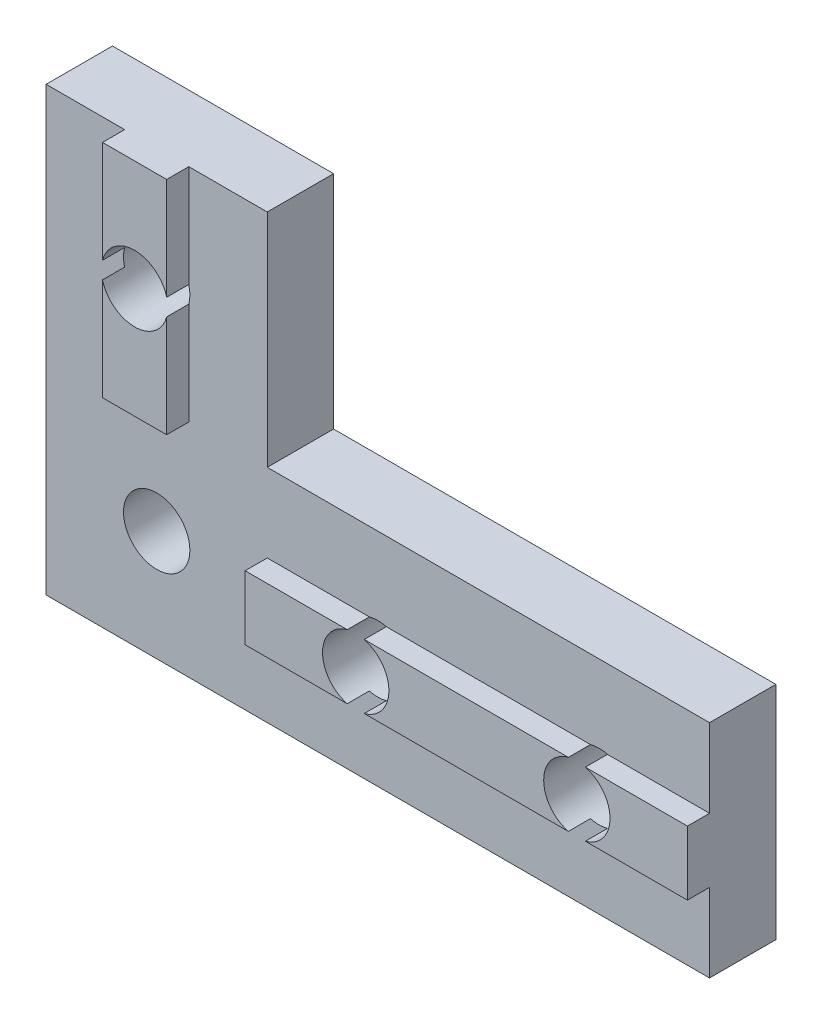
ISO-10303-21;
HEADER;
FILE_DESCRIPTION(('STEP AP214'),'2;1');
FILE_NAME('part.step','',(''),(''),'','','');
FILE_SCHEMA(('AUTOMOTIVE_DESIGN { 1 0 10303 214 1 1 1 1 }'));
ENDSEC;
DATA;
#1=APPLICATION_CONTEXT('core data for automotive mechanical design processes');
#2=APPLICATION_PROTOCOL_DEFINITION('international standard','automotive_design',2000,#1);
#3=PRODUCT_CONTEXT('',#1,'mechanical');
#4=PRODUCT('Part','Part','',(#3));
#5=PRODUCT_RELATED_PRODUCT_CATEGORY('part','',(#4));
#6=PRODUCT_DEFINITION_FORMATION('','',#4);
#7=PRODUCT_DEFINITION_CONTEXT('part definition',#1,'design');
#8=PRODUCT_DEFINITION('design','',#6,#7);
#9=PRODUCT_DEFINITION_SHAPE('','',#8);
#10=(LENGTH_UNIT() NAMED_UNIT(*) SI_UNIT(.MILLI.,.METRE.));
#11=(NAMED_UNIT(*) PLANE_ANGLE_UNIT() SI_UNIT($,.RADIAN.));
#12=(NAMED_UNIT(*) SI_UNIT($,.STERADIAN.) SOLID_ANGLE_UNIT());
#13=UNCERTAINTY_MEASURE_WITH_UNIT(LENGTH_MEASURE(1.E-05),#10,'distance_accuracy_value','');
#14=(GEOMETRIC_REPRESENTATION_CONTEXT(3) GLOBAL_UNCERTAINTY_ASSIGNED_CONTEXT((#13)) GLOBAL_UNIT_ASSIGNED_CONTEXT((#10,
#11,#12)) REPRESENTATION_CONTEXT('',''));
#15=CARTESIAN_POINT('',(0.,0.,0.));
#16=DIRECTION('',(0.,0.,1.));
#17=DIRECTION('',(1.,0.,0.));
#18=AXIS2_PLACEMENT_3D('',#15,#16,#17);
#19=CARTESIAN_POINT('',(30.,6.45,4.));
#20=DIRECTION('',(0.,-1.,0.));
#21=DIRECTION('',(0.,0.,-1.));
#22=AXIS2_PLACEMENT_3D('',#19,#20,#21);
#23=PLANE('',#22);
#24=DIRECTION('',(-1.,0.,0.));
#25=VECTOR('',#24,1.);
#26=CARTESIAN_POINT('',(30.,6.45,4.));
#27=LINE('',#26,#25);
#28=CARTESIAN_POINT('',(14.6159427126066,6.45,4.));
#29=VERTEX_POINT('',#28);
#30=CARTESIAN_POINT('',(10.,6.45,4.));
#31=VERTEX_POINT('',#30);
#32=EDGE_CURVE('E228',#29,#31,#27,.T.);
#33=ORIENTED_EDGE('',*,*,#32,.F.);
#34=DIRECTION('',(0.,0.,-1.));
#35=VECTOR('',#34,1.);
#36=CARTESIAN_POINT('',(14.6159427126066,6.45,4.));
#37=LINE('',#36,#35);
#38=CARTESIAN_POINT('',(14.6159427126066,6.45,3.));
#39=VERTEX_POINT('',#38);
#40=EDGE_CURVE('E55',#29,#39,#37,.T.);
#41=ORIENTED_EDGE('',*,*,#40,.T.);
#42=DIRECTION('',(-1.,0.,0.));
#43=VECTOR('',#42,1.);
#44=CARTESIAN_POINT('',(30.,6.45,3.));
#45=LINE('',#44,#43);
#46=CARTESIAN_POINT('',(10.,6.45,3.));
#47=VERTEX_POINT('',#46);
#48=EDGE_CURVE('E247',#39,#47,#45,.T.);
#49=ORIENTED_EDGE('',*,*,#48,.T.);
#50=DIRECTION('',(0.,0.,-1.));
#51=VECTOR('',#50,1.);
#52=CARTESIAN_POINT('',(10.,6.45,4.));
#53=LINE('',#52,#51);
#54=EDGE_CURVE('E259',#31,#47,#53,.T.);
#55=ORIENTED_EDGE('',*,*,#54,.F.);
#56=EDGE_LOOP('',(#33,#41,#49,#55));
#57=FACE_BOUND('',#56,.T.);
#58=ADVANCED_FACE('F33',(#57),#23,.F.);
#59=CARTESIAN_POINT('',(6.45,20.,4.));
#60=DIRECTION('',(-1.,0.,0.));
#61=DIRECTION('',(0.,-1.,0.));
#62=AXIS2_PLACEMENT_3D('',#59,#60,#61);
#63=PLANE('',#62);
#64=DIRECTION('',(0.,1.,0.));
#65=VECTOR('',#64,1.);
#66=CARTESIAN_POINT('',(6.45,20.,4.));
#67=LINE('',#66,#65);
#68=CARTESIAN_POINT('',(6.45,15.3840572873934,4.));
#69=VERTEX_POINT('',#68);
#70=CARTESIAN_POINT('',(6.45,20.,4.));
#71=VERTEX_POINT('',#70);
#72=EDGE_CURVE('E269',#69,#71,#67,.T.);
#73=ORIENTED_EDGE('',*,*,#72,.F.);
#74=DIRECTION('',(0.,0.,-1.));
#75=VECTOR('',#74,1.);
#76=CARTESIAN_POINT('',(6.45,15.3840572873934,4.));
#77=LINE('',#76,#75);
#78=CARTESIAN_POINT('',(6.45,15.3840572873934,3.));
#79=VERTEX_POINT('',#78);
#80=EDGE_CURVE('E420',#69,#79,#77,.T.);
#81=ORIENTED_EDGE('',*,*,#80,.T.);
#82=DIRECTION('',(0.,1.,0.));
#83=VECTOR('',#82,1.);
#84=CARTESIAN_POINT('',(6.45,20.,3.));
#85=LINE('',#84,#83);
#86=CARTESIAN_POINT('',(6.45,20.,3.));
#87=VERTEX_POINT('',#86);
#88=EDGE_CURVE('E264',#79,#87,#85,.T.);
#89=ORIENTED_EDGE('',*,*,#88,.T.);
#90=DIRECTION('',(0.,0.,-1.));
#91=VECTOR('',#90,1.);
#92=CARTESIAN_POINT('',(6.45,20.,4.));
#93=LINE('',#92,#91);
#94=EDGE_CURVE('E296',#71,#87,#93,.T.);
#95=ORIENTED_EDGE('',*,*,#94,.F.);
#96=EDGE_LOOP('',(#73,#81,#89,#95));
#97=FACE_BOUND('',#96,.T.);
#98=ADVANCED_FACE('F419',(#97),#63,.F.);
#99=CARTESIAN_POINT('',(3.55,20.,4.));
#100=DIRECTION('',(1.,0.,0.));
#101=DIRECTION('',(0.,1.,0.));
#102=AXIS2_PLACEMENT_3D('',#99,#100,#101);
#103=PLANE('',#102);
#104=DIRECTION('',(0.,-1.,0.));
#105=VECTOR('',#104,1.);
#106=CARTESIAN_POINT('',(3.55,20.,4.));
#107=LINE('',#106,#105);
#108=CARTESIAN_POINT('',(3.55,14.6159427126066,4.));
#109=VERTEX_POINT('',#108);
#110=CARTESIAN_POINT('',(3.55,10.,4.));
#111=VERTEX_POINT('',#110);
#112=EDGE_CURVE('E271',#109,#111,#107,.T.);
#113=ORIENTED_EDGE('',*,*,#112,.F.);
#114=DIRECTION('',(0.,0.,-1.));
#115=VECTOR('',#114,1.);
#116=CARTESIAN_POINT('',(3.55,14.6159427126066,4.));
#117=LINE('',#116,#115);
#118=CARTESIAN_POINT('',(3.55,14.6159427126066,3.));
#119=VERTEX_POINT('',#118);
#120=EDGE_CURVE('E48',#109,#119,#117,.T.);
#121=ORIENTED_EDGE('',*,*,#120,.T.);
#122=DIRECTION('',(0.,-1.,0.));
#123=VECTOR('',#122,1.);
#124=CARTESIAN_POINT('',(3.55,20.,3.));
#125=LINE('',#124,#123);
#126=CARTESIAN_POINT('',(3.55,10.,3.));
#127=VERTEX_POINT('',#126);
#128=EDGE_CURVE('E281',#119,#127,#125,.T.);
#129=ORIENTED_EDGE('',*,*,#128,.T.);
#130=DIRECTION('',(0.,0.,-1.));
#131=VECTOR('',#130,1.);
#132=CARTESIAN_POINT('',(3.55,10.,4.));
#133=LINE('',#132,#131);
#134=EDGE_CURVE('E290',#111,#127,#133,.T.);
#135=ORIENTED_EDGE('',*,*,#134,.F.);
#136=EDGE_LOOP('',(#113,#121,#129,#135));
#137=FACE_BOUND('',#136,.T.);
#138=ADVANCED_FACE('F485',(#137),#103,.F.);
#139=CARTESIAN_POINT('',(0.,0.,4.));
#140=DIRECTION('',(0.,0.,-1.));
#141=DIRECTION('',(-1.,0.,0.));
#142=AXIS2_PLACEMENT_3D('',#139,#140,#141);
#143=PLANE('',#142);
#144=CARTESIAN_POINT('',(3.55,20.,4.));
#145=VERTEX_POINT('',#144);
#146=CARTESIAN_POINT('',(3.55,15.3840572873934,4.));
#147=VERTEX_POINT('',#146);
#148=EDGE_CURVE('E272',#145,#147,#107,.T.);
#149=ORIENTED_EDGE('',*,*,#148,.T.);
#150=CARTESIAN_POINT('',(5.,15.,4.));
#151=DIRECTION('',(0.,0.,-1.));
#152=DIRECTION('',(-1.,0.,0.));
#153=AXIS2_PLACEMENT_3D('',#150,#151,#152);
#154=CIRCLE('',#153,1.5);
#155=EDGE_CURVE('E448',#147,#69,#154,.T.);
#156=ORIENTED_EDGE('',*,*,#155,.T.);
#157=ORIENTED_EDGE('',*,*,#72,.T.);
#158=DIRECTION('',(-1.,0.,0.));
#159=VECTOR('',#158,1.);
#160=CARTESIAN_POINT('',(6.45,20.,4.));
#161=LINE('',#160,#159);
#162=EDGE_CURVE('E268',#71,#145,#161,.T.);
#163=ORIENTED_EDGE('',*,*,#162,.T.);
#164=EDGE_LOOP('',(#149,#156,#157,#163));
#165=FACE_BOUND('',#164,.T.);
#166=ADVANCED_FACE('F477',(#165),#143,.F.);
#167=CARTESIAN_POINT('',(30.,3.55,4.));
#168=DIRECTION('',(0.,1.,0.));
#169=DIRECTION('',(-1.,0.,0.));
#170=AXIS2_PLACEMENT_3D('',#167,#168,#169);
#171=PLANE('',#170);
#172=DIRECTION('',(1.,0.,0.));
#173=VECTOR('',#172,1.);
#174=CARTESIAN_POINT('',(30.,3.55,4.));
#175=LINE('',#174,#173);
#176=CARTESIAN_POINT('',(15.3840572873934,3.55,4.));
#177=VERTEX_POINT('',#176);
#178=CARTESIAN_POINT('',(24.6159427126066,3.55,4.));
#179=VERTEX_POINT('',#178);
#180=EDGE_CURVE('E242',#177,#179,#175,.T.);
#181=ORIENTED_EDGE('',*,*,#180,.F.);
#182=DIRECTION('',(0.,0.,-1.));
#183=VECTOR('',#182,1.);
#184=CARTESIAN_POINT('',(15.3840572873934,3.55,4.));
#185=LINE('',#184,#183);
#186=CARTESIAN_POINT('',(15.3840572873934,3.55,3.));
#187=VERTEX_POINT('',#186);
#188=EDGE_CURVE('E208',#177,#187,#185,.T.);
#189=ORIENTED_EDGE('',*,*,#188,.T.);
#190=DIRECTION('',(1.,0.,0.));
#191=VECTOR('',#190,1.);
#192=CARTESIAN_POINT('',(30.,3.55,3.));
#193=LINE('',#192,#191);
#194=CARTESIAN_POINT('',(24.6159427126066,3.55,3.));
#195=VERTEX_POINT('',#194);
#196=EDGE_CURVE('E254',#187,#195,#193,.T.);
#197=ORIENTED_EDGE('',*,*,#196,.T.);
#198=DIRECTION('',(0.,0.,-1.));
#199=VECTOR('',#198,1.);
#200=CARTESIAN_POINT('',(24.6159427126066,3.55,4.));
#201=LINE('',#200,#199);
#202=EDGE_CURVE('E368',#195,#179,#201,.F.);
#203=ORIENTED_EDGE('',*,*,#202,.T.);
#204=EDGE_LOOP('',(#181,#189,#197,#203));
#205=FACE_BOUND('',#204,.T.);
#206=ADVANCED_FACE('F371',(#205),#171,.F.);
#207=CARTESIAN_POINT('',(0.,0.,4.));
#208=DIRECTION('',(0.,0.,-1.));
#209=DIRECTION('',(-1.,0.,0.));
#210=AXIS2_PLACEMENT_3D('',#207,#208,#209);
#211=PLANE('',#210);
#212=CARTESIAN_POINT('',(24.6159427126066,6.45,4.));
#213=VERTEX_POINT('',#212);
#214=CARTESIAN_POINT('',(15.3840572873934,6.45,4.));
#215=VERTEX_POINT('',#214);
#216=EDGE_CURVE('E218',#213,#215,#27,.T.);
#217=ORIENTED_EDGE('',*,*,#216,.T.);
#218=CARTESIAN_POINT('',(15.,5.,4.));
#219=DIRECTION('',(0.,0.,-1.));
#220=DIRECTION('',(-1.,0.,0.));
#221=AXIS2_PLACEMENT_3D('',#218,#219,#220);
#222=CIRCLE('',#221,1.5);
#223=EDGE_CURVE('E41',#215,#177,#222,.T.);
#224=ORIENTED_EDGE('',*,*,#223,.T.);
#225=ORIENTED_EDGE('',*,*,#180,.T.);
#226=CARTESIAN_POINT('',(25.,5.,4.));
#227=DIRECTION('',(0.,0.,-1.));
#228=DIRECTION('',(-1.,0.,0.));
#229=AXIS2_PLACEMENT_3D('',#226,#227,#228);
#230=CIRCLE('',#229,1.5);
#231=EDGE_CURVE('E226',#179,#213,#230,.T.);
#232=ORIENTED_EDGE('',*,*,#231,.T.);
#233=EDGE_LOOP('',(#217,#224,#225,#232));
#234=FACE_BOUND('',#233,.T.);
#235=ADVANCED_FACE('F224',(#234),#211,.F.);
#236=CARTESIAN_POINT('',(24.6159427126066,6.45,3.));
#237=VERTEX_POINT('',#236);
#238=CARTESIAN_POINT('',(15.3840572873934,6.45,3.));
#239=VERTEX_POINT('',#238);
#240=EDGE_CURVE('E220',#237,#239,#45,.T.);
#241=ORIENTED_EDGE('',*,*,#240,.T.);
#242=DIRECTION('',(0.,0.,-1.));
#243=VECTOR('',#242,1.);
#244=CARTESIAN_POINT('',(15.3840572873934,6.45,4.));
#245=LINE('',#244,#243);
#246=EDGE_CURVE('E205',#239,#215,#245,.F.);
#247=ORIENTED_EDGE('',*,*,#246,.T.);
#248=ORIENTED_EDGE('',*,*,#216,.F.);
#249=DIRECTION('',(0.,0.,-1.));
#250=VECTOR('',#249,1.);
#251=CARTESIAN_POINT('',(24.6159427126066,6.45,4.));
#252=LINE('',#251,#250);
#253=EDGE_CURVE('E370',#213,#237,#252,.T.);
#254=ORIENTED_EDGE('',*,*,#253,.T.);
#255=EDGE_LOOP('',(#241,#247,#248,#254));
#256=FACE_BOUND('',#255,.T.);
#257=ADVANCED_FACE('F216',(#256),#23,.F.);
#258=CARTESIAN_POINT('',(25.3840572873934,3.55,4.));
#259=VERTEX_POINT('',#258);
#260=CARTESIAN_POINT('',(30.,3.55,4.));
#261=VERTEX_POINT('',#260);
#262=EDGE_CURVE('E237',#259,#261,#175,.T.);
#263=ORIENTED_EDGE('',*,*,#262,.F.);
#264=DIRECTION('',(0.,0.,-1.));
#265=VECTOR('',#264,1.);
#266=CARTESIAN_POINT('',(25.3840572873934,3.55,4.));
#267=LINE('',#266,#265);
#268=CARTESIAN_POINT('',(25.3840572873934,3.55,3.));
#269=VERTEX_POINT('',#268);
#270=EDGE_CURVE('E361',#259,#269,#267,.T.);
#271=ORIENTED_EDGE('',*,*,#270,.T.);
#272=CARTESIAN_POINT('',(30.,3.55,3.));
#273=VERTEX_POINT('',#272);
#274=EDGE_CURVE('E250',#269,#273,#193,.T.);
#275=ORIENTED_EDGE('',*,*,#274,.T.);
#276=DIRECTION('',(0.,0.,-1.));
#277=VECTOR('',#276,1.);
#278=CARTESIAN_POINT('',(30.,3.55,4.));
#279=LINE('',#278,#277);
#280=EDGE_CURVE('E241',#261,#273,#279,.T.);
#281=ORIENTED_EDGE('',*,*,#280,.F.);
#282=EDGE_LOOP('',(#263,#271,#275,#281));
#283=FACE_BOUND('',#282,.T.);
#284=ADVANCED_FACE('F360',(#283),#171,.F.);
#285=CARTESIAN_POINT('',(30.,6.45,4.));
#286=VERTEX_POINT('',#285);
#287=CARTESIAN_POINT('',(25.3840572873934,6.45,4.));
#288=VERTEX_POINT('',#287);
#289=EDGE_CURVE('E227',#286,#288,#27,.T.);
#290=ORIENTED_EDGE('',*,*,#289,.T.);
#291=EDGE_CURVE('E347',#288,#259,#230,.T.);
#292=ORIENTED_EDGE('',*,*,#291,.T.);
#293=ORIENTED_EDGE('',*,*,#262,.T.);
#294=DIRECTION('',(0.,1.,0.));
#295=VECTOR('',#294,1.);
#296=CARTESIAN_POINT('',(30.,6.45,4.));
#297=LINE('',#296,#295);
#298=EDGE_CURVE('E232',#261,#286,#297,.T.);
#299=ORIENTED_EDGE('',*,*,#298,.T.);
#300=EDGE_LOOP('',(#290,#292,#293,#299));
#301=FACE_BOUND('',#300,.T.);
#302=ADVANCED_FACE('F353',(#301),#211,.F.);
#303=CARTESIAN_POINT('',(0.,0.,3.));
#304=DIRECTION('',(0.,0.,1.));
#305=DIRECTION('',(1.,0.,0.));
#306=AXIS2_PLACEMENT_3D('',#303,#304,#305);
#307=PLANE('',#306);
#308=CARTESIAN_POINT('',(15.,5.,3.));
#309=DIRECTION('',(0.,0.,1.));
#310=DIRECTION('',(1.,0.,0.));
#311=AXIS2_PLACEMENT_3D('',#308,#309,#310);
#312=CIRCLE('',#311,1.5);
#313=EDGE_CURVE('E221',#239,#39,#312,.T.);
#314=ORIENTED_EDGE('',*,*,#313,.F.);
#315=ORIENTED_EDGE('',*,*,#240,.F.);
#316=CARTESIAN_POINT('',(25.,5.,3.));
#317=DIRECTION('',(0.,0.,1.));
#318=DIRECTION('',(1.,0.,0.));
#319=AXIS2_PLACEMENT_3D('',#316,#317,#318);
#320=CIRCLE('',#319,1.5);
#321=CARTESIAN_POINT('',(25.3840572873934,6.45,3.));
#322=VERTEX_POINT('',#321);
#323=EDGE_CURVE('E377',#322,#237,#320,.T.);
#324=ORIENTED_EDGE('',*,*,#323,.F.);
#325=CARTESIAN_POINT('',(30.,6.45,3.));
#326=VERTEX_POINT('',#325);
#327=EDGE_CURVE('E243',#326,#322,#45,.T.);
#328=ORIENTED_EDGE('',*,*,#327,.F.);
#329=DIRECTION('',(0.,1.,0.));
#330=VECTOR('',#329,1.);
#331=CARTESIAN_POINT('',(30.,0.,3.));
#332=LINE('',#331,#330);
#333=CARTESIAN_POINT('',(30.,10.,3.));
#334=VERTEX_POINT('',#333);
#335=EDGE_CURVE('E306',#326,#334,#332,.T.);
#336=ORIENTED_EDGE('',*,*,#335,.T.);
#337=DIRECTION('',(-1.,0.,0.));
#338=VECTOR('',#337,1.);
#339=CARTESIAN_POINT('',(30.,10.,3.));
#340=LINE('',#339,#338);
#341=CARTESIAN_POINT('',(10.,10.,3.));
#342=VERTEX_POINT('',#341);
#343=EDGE_CURVE('E310',#334,#342,#340,.T.);
#344=ORIENTED_EDGE('',*,*,#343,.T.);
#345=DIRECTION('',(0.,1.,0.));
#346=VECTOR('',#345,1.);
#347=CARTESIAN_POINT('',(10.,10.,3.));
#348=LINE('',#347,#346);
#349=CARTESIAN_POINT('',(10.,20.,3.));
#350=VERTEX_POINT('',#349);
#351=EDGE_CURVE('E312',#342,#350,#348,.T.);
#352=ORIENTED_EDGE('',*,*,#351,.T.);
#353=DIRECTION('',(-1.,0.,0.));
#354=VECTOR('',#353,1.);
#355=CARTESIAN_POINT('',(10.,20.,3.));
#356=LINE('',#355,#354);
#357=EDGE_CURVE('E315',#350,#87,#356,.T.);
#358=ORIENTED_EDGE('',*,*,#357,.T.);
#359=ORIENTED_EDGE('',*,*,#88,.F.);
#360=CARTESIAN_POINT('',(5.,15.,3.));
#361=DIRECTION('',(0.,0.,1.));
#362=DIRECTION('',(1.,0.,0.));
#363=AXIS2_PLACEMENT_3D('',#360,#361,#362);
#364=CIRCLE('',#363,1.5);
#365=CARTESIAN_POINT('',(6.45,14.6159427126066,3.));
#366=VERTEX_POINT('',#365);
#367=EDGE_CURVE('E415',#366,#79,#364,.T.);
#368=ORIENTED_EDGE('',*,*,#367,.F.);
#369=CARTESIAN_POINT('',(6.45000000000001,10.,3.));
#370=VERTEX_POINT('',#369);
#371=EDGE_CURVE('E278',#370,#366,#85,.T.);
#372=ORIENTED_EDGE('',*,*,#371,.F.);
#373=DIRECTION('',(1.,0.,0.));
#374=VECTOR('',#373,1.);
#375=CARTESIAN_POINT('',(6.45000000000001,10.,3.));
#376=LINE('',#375,#374);
#377=EDGE_CURVE('E285',#127,#370,#376,.T.);
#378=ORIENTED_EDGE('',*,*,#377,.F.);
#379=ORIENTED_EDGE('',*,*,#128,.F.);
#380=CARTESIAN_POINT('',(3.55,15.3840572873934,3.));
#381=VERTEX_POINT('',#380);
#382=EDGE_CURVE('E426',#381,#119,#364,.T.);
#383=ORIENTED_EDGE('',*,*,#382,.F.);
#384=CARTESIAN_POINT('',(3.55,20.,3.));
#385=VERTEX_POINT('',#384);
#386=EDGE_CURVE('E282',#385,#381,#125,.T.);
#387=ORIENTED_EDGE('',*,*,#386,.F.);
#388=CARTESIAN_POINT('',(0.,20.,3.));
#389=VERTEX_POINT('',#388);
#390=EDGE_CURVE('E314',#385,#389,#356,.T.);
#391=ORIENTED_EDGE('',*,*,#390,.T.);
#392=DIRECTION('',(0.,-1.,0.));
#393=VECTOR('',#392,1.);
#394=CARTESIAN_POINT('',(0.,20.,3.));
#395=LINE('',#394,#393);
#396=CARTESIAN_POINT('',(0.,0.,3.));
#397=VERTEX_POINT('',#396);
#398=EDGE_CURVE('E300',#389,#397,#395,.T.);
#399=ORIENTED_EDGE('',*,*,#398,.T.);
#400=DIRECTION('',(1.,0.,0.));
#401=VECTOR('',#400,1.);
#402=CARTESIAN_POINT('',(0.,0.,3.));
#403=LINE('',#402,#401);
#404=CARTESIAN_POINT('',(30.,0.,3.));
#405=VERTEX_POINT('',#404);
#406=EDGE_CURVE('E303',#397,#405,#403,.T.);
#407=ORIENTED_EDGE('',*,*,#406,.T.);
#408=EDGE_CURVE('E307',#405,#273,#332,.T.);
#409=ORIENTED_EDGE('',*,*,#408,.T.);
#410=ORIENTED_EDGE('',*,*,#274,.F.);
#411=EDGE_CURVE('E373',#195,#269,#320,.T.);
#412=ORIENTED_EDGE('',*,*,#411,.F.);
#413=ORIENTED_EDGE('',*,*,#196,.F.);
#414=CARTESIAN_POINT('',(14.6159427126066,3.55,3.));
#415=VERTEX_POINT('',#414);
#416=EDGE_CURVE('E436',#415,#187,#312,.T.);
#417=ORIENTED_EDGE('',*,*,#416,.F.);
#418=CARTESIAN_POINT('',(10.,3.55,3.));
#419=VERTEX_POINT('',#418);
#420=EDGE_CURVE('E251',#419,#415,#193,.T.);
#421=ORIENTED_EDGE('',*,*,#420,.F.);
#422=DIRECTION('',(0.,-1.,0.));
#423=VECTOR('',#422,1.);
#424=CARTESIAN_POINT('',(10.,6.45,3.));
#425=LINE('',#424,#423);
#426=EDGE_CURVE('E246',#47,#419,#425,.T.);
#427=ORIENTED_EDGE('',*,*,#426,.F.);
#428=ORIENTED_EDGE('',*,*,#48,.F.);
#429=EDGE_LOOP('',(#314,#315,#324,#328,#336,#344,#352,#358,#359,#368,#372,#378,#379,#383,#387,
#391,#399,#407,#409,#410,#412,#413,#417,#421,#427,#428));
#430=FACE_BOUND('',#429,.T.);
#431=CARTESIAN_POINT('',(5.,5.,3.));
#432=DIRECTION('',(0.,0.,1.));
#433=DIRECTION('',(1.,0.,0.));
#434=AXIS2_PLACEMENT_3D('',#431,#432,#433);
#435=CIRCLE('',#434,1.5);
#436=CARTESIAN_POINT('',(6.5,5.,3.));
#437=VERTEX_POINT('',#436);
#438=EDGE_CURVE('E379',#437,#437,#435,.T.);
#439=ORIENTED_EDGE('',*,*,#438,.F.);
#440=EDGE_LOOP('',(#439));
#441=FACE_BOUND('',#440,.T.);
#442=ADVANCED_FACE('F388',(#430,#441),#307,.T.);
#443=CARTESIAN_POINT('',(0.,20.,3.));
#444=DIRECTION('',(1.,0.,0.));
#445=DIRECTION('',(0.,1.,0.));
#446=AXIS2_PLACEMENT_3D('',#443,#444,#445);
#447=PLANE('',#446);
#448=DIRECTION('',(0.,-1.,0.));
#449=VECTOR('',#448,1.);
#450=CARTESIAN_POINT('',(0.,20.,0.));
#451=LINE('',#450,#449);
#452=CARTESIAN_POINT('',(0.,20.,0.));
#453=VERTEX_POINT('',#452);
#454=CARTESIAN_POINT('',(0.,0.,0.));
#455=VERTEX_POINT('',#454);
#456=EDGE_CURVE('E299',#453,#455,#451,.T.);
#457=ORIENTED_EDGE('',*,*,#456,.T.);
#458=DIRECTION('',(0.,0.,-1.));
#459=VECTOR('',#458,1.);
#460=CARTESIAN_POINT('',(0.,0.,3.));
#461=LINE('',#460,#459);
#462=EDGE_CURVE('E344',#397,#455,#461,.T.);
#463=ORIENTED_EDGE('',*,*,#462,.F.);
#464=ORIENTED_EDGE('',*,*,#398,.F.);
#465=DIRECTION('',(0.,0.,-1.));
#466=VECTOR('',#465,1.);
#467=CARTESIAN_POINT('',(0.,20.,3.));
#468=LINE('',#467,#466);
#469=EDGE_CURVE('E318',#389,#453,#468,.T.);
#470=ORIENTED_EDGE('',*,*,#469,.T.);
#471=EDGE_LOOP('',(#457,#463,#464,#470));
#472=FACE_BOUND('',#471,.T.);
#473=ADVANCED_FACE('F35',(#472),#447,.F.);
#474=CARTESIAN_POINT('',(0.,0.,3.));
#475=DIRECTION('',(0.,1.,0.));
#476=DIRECTION('',(0.,0.,1.));
#477=AXIS2_PLACEMENT_3D('',#474,#475,#476);
#478=PLANE('',#477);
#479=DIRECTION('',(1.,0.,0.));
#480=VECTOR('',#479,1.);
#481=CARTESIAN_POINT('',(0.,0.,0.));
#482=LINE('',#481,#480);
#483=CARTESIAN_POINT('',(30.,0.,0.));
#484=VERTEX_POINT('',#483);
#485=EDGE_CURVE('E321',#455,#484,#482,.T.);
#486=ORIENTED_EDGE('',*,*,#485,.T.);
#487=DIRECTION('',(0.,0.,-1.));
#488=VECTOR('',#487,1.);
#489=CARTESIAN_POINT('',(30.,0.,3.));
#490=LINE('',#489,#488);
#491=EDGE_CURVE('E341',#405,#484,#490,.T.);
#492=ORIENTED_EDGE('',*,*,#491,.F.);
#493=ORIENTED_EDGE('',*,*,#406,.F.);
#494=ORIENTED_EDGE('',*,*,#462,.T.);
#495=EDGE_LOOP('',(#486,#492,#493,#494));
#496=FACE_BOUND('',#495,.T.);
#497=ADVANCED_FACE('F671',(#496),#478,.F.);
#498=CARTESIAN_POINT('',(30.,0.,3.));
#499=DIRECTION('',(-1.,0.,0.));
#500=DIRECTION('',(0.,0.,1.));
#501=AXIS2_PLACEMENT_3D('',#498,#499,#500);
#502=PLANE('',#501);
#503=DIRECTION('',(0.,1.,0.));
#504=VECTOR('',#503,1.);
#505=CARTESIAN_POINT('',(30.,0.,0.));
#506=LINE('',#505,#504);
#507=CARTESIAN_POINT('',(30.,10.,0.));
#508=VERTEX_POINT('',#507);
#509=EDGE_CURVE('E323',#484,#508,#506,.T.);
#510=ORIENTED_EDGE('',*,*,#509,.T.);
#511=DIRECTION('',(0.,0.,-1.));
#512=VECTOR('',#511,1.);
#513=CARTESIAN_POINT('',(30.,10.,3.));
#514=LINE('',#513,#512);
#515=EDGE_CURVE('E338',#334,#508,#514,.T.);
#516=ORIENTED_EDGE('',*,*,#515,.F.);
#517=ORIENTED_EDGE('',*,*,#335,.F.);
#518=DIRECTION('',(0.,0.,-1.));
#519=VECTOR('',#518,1.);
#520=CARTESIAN_POINT('',(30.,6.45,4.));
#521=LINE('',#520,#519);
#522=EDGE_CURVE('E262',#286,#326,#521,.T.);
#523=ORIENTED_EDGE('',*,*,#522,.F.);
#524=ORIENTED_EDGE('',*,*,#298,.F.);
#525=ORIENTED_EDGE('',*,*,#280,.T.);
#526=ORIENTED_EDGE('',*,*,#408,.F.);
#527=ORIENTED_EDGE('',*,*,#491,.T.);
#528=EDGE_LOOP('',(#510,#516,#517,#523,#524,#525,#526,#527));
#529=FACE_BOUND('',#528,.T.);
#530=ADVANCED_FACE('F395',(#529),#502,.F.);
#531=CARTESIAN_POINT('',(30.,10.,3.));
#532=DIRECTION('',(0.,-1.,0.));
#533=DIRECTION('',(1.,0.,0.));
#534=AXIS2_PLACEMENT_3D('',#531,#532,#533);
#535=PLANE('',#534);
#536=DIRECTION('',(-1.,0.,0.));
#537=VECTOR('',#536,1.);
#538=CARTESIAN_POINT('',(30.,10.,0.));
#539=LINE('',#538,#537);
#540=CARTESIAN_POINT('',(10.,10.,0.));
#541=VERTEX_POINT('',#540);
#542=EDGE_CURVE('E325',#508,#541,#539,.T.);
#543=ORIENTED_EDGE('',*,*,#542,.T.);
#544=DIRECTION('',(0.,0.,-1.));
#545=VECTOR('',#544,1.);
#546=CARTESIAN_POINT('',(10.,10.,3.));
#547=LINE('',#546,#545);
#548=EDGE_CURVE('E335',#342,#541,#547,.T.);
#549=ORIENTED_EDGE('',*,*,#548,.F.);
#550=ORIENTED_EDGE('',*,*,#343,.F.);
#551=ORIENTED_EDGE('',*,*,#515,.T.);
#552=EDGE_LOOP('',(#543,#549,#550,#551));
#553=FACE_BOUND('',#552,.T.);
#554=ADVANCED_FACE('F402',(#553),#535,.F.);
#555=CARTESIAN_POINT('',(10.,10.,3.));
#556=DIRECTION('',(-1.,0.,0.));
#557=DIRECTION('',(0.,0.,1.));
#558=AXIS2_PLACEMENT_3D('',#555,#556,#557);
#559=PLANE('',#558);
#560=DIRECTION('',(0.,1.,0.));
#561=VECTOR('',#560,1.);
#562=CARTESIAN_POINT('',(10.,10.,0.));
#563=LINE('',#562,#561);
#564=CARTESIAN_POINT('',(10.,20.,0.));
#565=VERTEX_POINT('',#564);
#566=EDGE_CURVE('E327',#541,#565,#563,.T.);
#567=ORIENTED_EDGE('',*,*,#566,.T.);
#568=DIRECTION('',(0.,0.,-1.));
#569=VECTOR('',#568,1.);
#570=CARTESIAN_POINT('',(10.,20.,3.));
#571=LINE('',#570,#569);
#572=EDGE_CURVE('E332',#350,#565,#571,.T.);
#573=ORIENTED_EDGE('',*,*,#572,.F.);
#574=ORIENTED_EDGE('',*,*,#351,.F.);
#575=ORIENTED_EDGE('',*,*,#548,.T.);
#576=EDGE_LOOP('',(#567,#573,#574,#575));
#577=FACE_BOUND('',#576,.T.);
#578=ADVANCED_FACE('F406',(#577),#559,.F.);
#579=CARTESIAN_POINT('',(10.,20.,3.));
#580=DIRECTION('',(0.,-1.,0.));
#581=DIRECTION('',(1.,0.,0.));
#582=AXIS2_PLACEMENT_3D('',#579,#580,#581);
#583=PLANE('',#582);
#584=DIRECTION('',(-1.,0.,0.));
#585=VECTOR('',#584,1.);
#586=CARTESIAN_POINT('',(10.,20.,0.));
#587=LINE('',#586,#585);
#588=EDGE_CURVE('E304',#565,#453,#587,.T.);
#589=ORIENTED_EDGE('',*,*,#588,.T.);
#590=ORIENTED_EDGE('',*,*,#469,.F.);
#591=ORIENTED_EDGE('',*,*,#390,.F.);
#592=DIRECTION('',(0.,0.,-1.));
#593=VECTOR('',#592,1.);
#594=CARTESIAN_POINT('',(3.55,20.,4.));
#595=LINE('',#594,#593);
#596=EDGE_CURVE('E293',#145,#385,#595,.T.);
#597=ORIENTED_EDGE('',*,*,#596,.F.);
#598=ORIENTED_EDGE('',*,*,#162,.F.);
#599=ORIENTED_EDGE('',*,*,#94,.T.);
#600=ORIENTED_EDGE('',*,*,#357,.F.);
#601=ORIENTED_EDGE('',*,*,#572,.T.);
#602=EDGE_LOOP('',(#589,#590,#591,#597,#598,#599,#600,#601));
#603=FACE_BOUND('',#602,.T.);
#604=ADVANCED_FACE('F410',(#603),#583,.F.);
#605=CARTESIAN_POINT('',(0.,0.,0.));
#606=DIRECTION('',(0.,0.,1.));
#607=DIRECTION('',(1.,0.,0.));
#608=AXIS2_PLACEMENT_3D('',#605,#606,#607);
#609=PLANE('',#608);
#610=CARTESIAN_POINT('',(15.,5.,0.));
#611=DIRECTION('',(0.,0.,-1.));
#612=DIRECTION('',(-1.,0.,0.));
#613=AXIS2_PLACEMENT_3D('',#610,#611,#612);
#614=CIRCLE('',#613,1.5);
#615=CARTESIAN_POINT('',(13.5,5.,0.));
#616=VERTEX_POINT('',#615);
#617=EDGE_CURVE('E441',#616,#616,#614,.T.);
#618=ORIENTED_EDGE('',*,*,#617,.F.);
#619=EDGE_LOOP('',(#618));
#620=FACE_BOUND('',#619,.T.);
#621=CARTESIAN_POINT('',(5.,15.,0.));
#622=DIRECTION('',(0.,0.,-1.));
#623=DIRECTION('',(-1.,0.,0.));
#624=AXIS2_PLACEMENT_3D('',#621,#622,#623);
#625=CIRCLE('',#624,1.5);
#626=CARTESIAN_POINT('',(3.5,15.,0.));
#627=VERTEX_POINT('',#626);
#628=EDGE_CURVE('E445',#627,#627,#625,.T.);
#629=ORIENTED_EDGE('',*,*,#628,.F.);
#630=EDGE_LOOP('',(#629));
#631=FACE_BOUND('',#630,.T.);
#632=CARTESIAN_POINT('',(5.,5.,0.));
#633=DIRECTION('',(0.,0.,-1.));
#634=DIRECTION('',(-1.,0.,0.));
#635=AXIS2_PLACEMENT_3D('',#632,#633,#634);
#636=CIRCLE('',#635,1.5);
#637=CARTESIAN_POINT('',(3.5,5.,0.));
#638=VERTEX_POINT('',#637);
#639=EDGE_CURVE('E442',#638,#638,#636,.T.);
#640=ORIENTED_EDGE('',*,*,#639,.F.);
#641=EDGE_LOOP('',(#640));
#642=FACE_BOUND('',#641,.T.);
#643=CARTESIAN_POINT('',(25.,5.,0.));
#644=DIRECTION('',(0.,0.,-1.));
#645=DIRECTION('',(-1.,0.,0.));
#646=AXIS2_PLACEMENT_3D('',#643,#644,#645);
#647=CIRCLE('',#646,1.5);
#648=CARTESIAN_POINT('',(23.5,5.,0.));
#649=VERTEX_POINT('',#648);
#650=EDGE_CURVE('E374',#649,#649,#647,.T.);
#651=ORIENTED_EDGE('',*,*,#650,.F.);
#652=EDGE_LOOP('',(#651));
#653=FACE_BOUND('',#652,.T.);
#654=ORIENTED_EDGE('',*,*,#456,.F.);
#655=ORIENTED_EDGE('',*,*,#588,.F.);
#656=ORIENTED_EDGE('',*,*,#566,.F.);
#657=ORIENTED_EDGE('',*,*,#542,.F.);
#658=ORIENTED_EDGE('',*,*,#509,.F.);
#659=ORIENTED_EDGE('',*,*,#485,.F.);
#660=EDGE_LOOP('',(#654,#655,#656,#657,#658,#659));
#661=FACE_BOUND('',#660,.T.);
#662=ADVANCED_FACE('F454',(#620,#631,#642,#653,#661),#609,.F.);
#663=ORIENTED_EDGE('',*,*,#371,.T.);
#664=DIRECTION('',(0.,0.,-1.));
#665=VECTOR('',#664,1.);
#666=CARTESIAN_POINT('',(6.45,14.6159427126066,4.));
#667=LINE('',#666,#665);
#668=CARTESIAN_POINT('',(6.45000000000001,14.6159427126066,4.));
#669=VERTEX_POINT('',#668);
#670=EDGE_CURVE('E424',#366,#669,#667,.F.);
#671=ORIENTED_EDGE('',*,*,#670,.T.);
#672=CARTESIAN_POINT('',(6.45000000000001,10.,4.));
#673=VERTEX_POINT('',#672);
#674=EDGE_CURVE('E265',#673,#669,#67,.T.);
#675=ORIENTED_EDGE('',*,*,#674,.F.);
#676=DIRECTION('',(0.,0.,-1.));
#677=VECTOR('',#676,1.);
#678=CARTESIAN_POINT('',(6.45000000000001,10.,4.));
#679=LINE('',#678,#677);
#680=EDGE_CURVE('E277',#673,#370,#679,.T.);
#681=ORIENTED_EDGE('',*,*,#680,.T.);
#682=EDGE_LOOP('',(#663,#671,#675,#681));
#683=FACE_BOUND('',#682,.T.);
#684=ADVANCED_FACE('F457',(#683),#63,.F.);
#685=ORIENTED_EDGE('',*,*,#386,.T.);
#686=DIRECTION('',(0.,0.,-1.));
#687=VECTOR('',#686,1.);
#688=CARTESIAN_POINT('',(3.55,15.3840572873934,4.));
#689=LINE('',#688,#687);
#690=EDGE_CURVE('E431',#381,#147,#689,.F.);
#691=ORIENTED_EDGE('',*,*,#690,.T.);
#692=ORIENTED_EDGE('',*,*,#148,.F.);
#693=ORIENTED_EDGE('',*,*,#596,.T.);
#694=EDGE_LOOP('',(#685,#691,#692,#693));
#695=FACE_BOUND('',#694,.T.);
#696=ADVANCED_FACE('F475',(#695),#103,.F.);
#697=CARTESIAN_POINT('',(6.45000000000001,10.,4.));
#698=DIRECTION('',(0.,1.,0.));
#699=DIRECTION('',(-1.,0.,0.));
#700=AXIS2_PLACEMENT_3D('',#697,#698,#699);
#701=PLANE('',#700);
#702=ORIENTED_EDGE('',*,*,#377,.T.);
#703=ORIENTED_EDGE('',*,*,#680,.F.);
#704=DIRECTION('',(1.,0.,0.));
#705=VECTOR('',#704,1.);
#706=CARTESIAN_POINT('',(6.45000000000001,10.,4.));
#707=LINE('',#706,#705);
#708=EDGE_CURVE('E275',#111,#673,#707,.T.);
#709=ORIENTED_EDGE('',*,*,#708,.F.);
#710=ORIENTED_EDGE('',*,*,#134,.T.);
#711=EDGE_LOOP('',(#702,#703,#709,#710));
#712=FACE_BOUND('',#711,.T.);
#713=ADVANCED_FACE('F493',(#712),#701,.F.);
#714=ORIENTED_EDGE('',*,*,#674,.T.);
#715=CARTESIAN_POINT('',(5.,15.,4.));
#716=DIRECTION('',(0.,0.,-1.));
#717=DIRECTION('',(-1.,0.,0.));
#718=AXIS2_PLACEMENT_3D('',#715,#716,#717);
#719=CIRCLE('',#718,1.5);
#720=EDGE_CURVE('E11',#669,#109,#719,.T.);
#721=ORIENTED_EDGE('',*,*,#720,.T.);
#722=ORIENTED_EDGE('',*,*,#112,.T.);
#723=ORIENTED_EDGE('',*,*,#708,.T.);
#724=EDGE_LOOP('',(#714,#721,#722,#723));
#725=FACE_BOUND('',#724,.T.);
#726=ADVANCED_FACE('F488',(#725),#143,.F.);
#727=ORIENTED_EDGE('',*,*,#327,.T.);
#728=DIRECTION('',(0.,0.,-1.));
#729=VECTOR('',#728,1.);
#730=CARTESIAN_POINT('',(25.3840572873934,6.45,4.));
#731=LINE('',#730,#729);
#732=EDGE_CURVE('E384',#322,#288,#731,.F.);
#733=ORIENTED_EDGE('',*,*,#732,.T.);
#734=ORIENTED_EDGE('',*,*,#289,.F.);
#735=ORIENTED_EDGE('',*,*,#522,.T.);
#736=EDGE_LOOP('',(#727,#733,#734,#735));
#737=FACE_BOUND('',#736,.T.);
#738=ADVANCED_FACE('F392',(#737),#23,.F.);
#739=CARTESIAN_POINT('',(10.,6.45,4.));
#740=DIRECTION('',(1.,0.,0.));
#741=DIRECTION('',(0.,0.,-1.));
#742=AXIS2_PLACEMENT_3D('',#739,#740,#741);
#743=PLANE('',#742);
#744=ORIENTED_EDGE('',*,*,#426,.T.);
#745=DIRECTION('',(0.,0.,-1.));
#746=VECTOR('',#745,1.);
#747=CARTESIAN_POINT('',(10.,3.55,4.));
#748=LINE('',#747,#746);
#749=CARTESIAN_POINT('',(10.,3.55,4.));
#750=VERTEX_POINT('',#749);
#751=EDGE_CURVE('E257',#750,#419,#748,.T.);
#752=ORIENTED_EDGE('',*,*,#751,.F.);
#753=DIRECTION('',(0.,-1.,0.));
#754=VECTOR('',#753,1.);
#755=CARTESIAN_POINT('',(10.,6.45,4.));
#756=LINE('',#755,#754);
#757=EDGE_CURVE('E231',#31,#750,#756,.T.);
#758=ORIENTED_EDGE('',*,*,#757,.F.);
#759=ORIENTED_EDGE('',*,*,#54,.T.);
#760=EDGE_LOOP('',(#744,#752,#758,#759));
#761=FACE_BOUND('',#760,.T.);
#762=ADVANCED_FACE('F512',(#761),#743,.F.);
#763=ORIENTED_EDGE('',*,*,#420,.T.);
#764=DIRECTION('',(0.,0.,-1.));
#765=VECTOR('',#764,1.);
#766=CARTESIAN_POINT('',(14.6159427126066,3.55,4.));
#767=LINE('',#766,#765);
#768=CARTESIAN_POINT('',(14.6159427126066,3.55,4.));
#769=VERTEX_POINT('',#768);
#770=EDGE_CURVE('E438',#415,#769,#767,.F.);
#771=ORIENTED_EDGE('',*,*,#770,.T.);
#772=EDGE_CURVE('E238',#750,#769,#175,.T.);
#773=ORIENTED_EDGE('',*,*,#772,.F.);
#774=ORIENTED_EDGE('',*,*,#751,.T.);
#775=EDGE_LOOP('',(#763,#771,#773,#774));
#776=FACE_BOUND('',#775,.T.);
#777=ADVANCED_FACE('F516',(#776),#171,.F.);
#778=ORIENTED_EDGE('',*,*,#772,.T.);
#779=EDGE_CURVE('E212',#769,#29,#222,.T.);
#780=ORIENTED_EDGE('',*,*,#779,.T.);
#781=ORIENTED_EDGE('',*,*,#32,.T.);
#782=ORIENTED_EDGE('',*,*,#757,.T.);
#783=EDGE_LOOP('',(#778,#780,#781,#782));
#784=FACE_BOUND('',#783,.T.);
#785=ADVANCED_FACE('F521',(#784),#211,.F.);
#786=CARTESIAN_POINT('',(25.,5.,4.));
#787=DIRECTION('',(0.,0.,-1.));
#788=DIRECTION('',(-1.,0.,0.));
#789=AXIS2_PLACEMENT_3D('',#786,#787,#788);
#790=CYLINDRICAL_SURFACE('',#789,1.5);
#791=ORIENTED_EDGE('',*,*,#650,.T.);
#792=EDGE_LOOP('',(#791));
#793=FACE_BOUND('',#792,.T.);
#794=ORIENTED_EDGE('',*,*,#231,.F.);
#795=ORIENTED_EDGE('',*,*,#202,.F.);
#796=ORIENTED_EDGE('',*,*,#411,.T.);
#797=ORIENTED_EDGE('',*,*,#270,.F.);
#798=ORIENTED_EDGE('',*,*,#291,.F.);
#799=ORIENTED_EDGE('',*,*,#732,.F.);
#800=ORIENTED_EDGE('',*,*,#323,.T.);
#801=ORIENTED_EDGE('',*,*,#253,.F.);
#802=EDGE_LOOP('',(#794,#795,#796,#797,#798,#799,#800,#801));
#803=FACE_BOUND('',#802,.T.);
#804=ADVANCED_FACE('F367',(#793,#803),#790,.F.);
#805=CARTESIAN_POINT('',(15.,5.,4.));
#806=DIRECTION('',(0.,0.,-1.));
#807=DIRECTION('',(-1.,0.,0.));
#808=AXIS2_PLACEMENT_3D('',#805,#806,#807);
#809=CYLINDRICAL_SURFACE('',#808,1.5);
#810=ORIENTED_EDGE('',*,*,#617,.T.);
#811=EDGE_LOOP('',(#810));
#812=FACE_BOUND('',#811,.T.);
#813=ORIENTED_EDGE('',*,*,#779,.F.);
#814=ORIENTED_EDGE('',*,*,#770,.F.);
#815=ORIENTED_EDGE('',*,*,#416,.T.);
#816=ORIENTED_EDGE('',*,*,#188,.F.);
#817=ORIENTED_EDGE('',*,*,#223,.F.);
#818=ORIENTED_EDGE('',*,*,#246,.F.);
#819=ORIENTED_EDGE('',*,*,#313,.T.);
#820=ORIENTED_EDGE('',*,*,#40,.F.);
#821=EDGE_LOOP('',(#813,#814,#815,#816,#817,#818,#819,#820));
#822=FACE_BOUND('',#821,.T.);
#823=ADVANCED_FACE('F204',(#812,#822),#809,.F.);
#824=CARTESIAN_POINT('',(5.,15.,4.));
#825=DIRECTION('',(0.,0.,-1.));
#826=DIRECTION('',(-1.,0.,0.));
#827=AXIS2_PLACEMENT_3D('',#824,#825,#826);
#828=CYLINDRICAL_SURFACE('',#827,1.5);
#829=ORIENTED_EDGE('',*,*,#628,.T.);
#830=EDGE_LOOP('',(#829));
#831=FACE_BOUND('',#830,.T.);
#832=ORIENTED_EDGE('',*,*,#155,.F.);
#833=ORIENTED_EDGE('',*,*,#690,.F.);
#834=ORIENTED_EDGE('',*,*,#382,.T.);
#835=ORIENTED_EDGE('',*,*,#120,.F.);
#836=ORIENTED_EDGE('',*,*,#720,.F.);
#837=ORIENTED_EDGE('',*,*,#670,.F.);
#838=ORIENTED_EDGE('',*,*,#367,.T.);
#839=ORIENTED_EDGE('',*,*,#80,.F.);
#840=EDGE_LOOP('',(#832,#833,#834,#835,#836,#837,#838,#839));
#841=FACE_BOUND('',#840,.T.);
#842=ADVANCED_FACE('F478',(#831,#841),#828,.F.);
#843=CARTESIAN_POINT('',(5.,5.,4.));
#844=DIRECTION('',(0.,0.,-1.));
#845=DIRECTION('',(-1.,0.,0.));
#846=AXIS2_PLACEMENT_3D('',#843,#844,#845);
#847=CYLINDRICAL_SURFACE('',#846,1.5);
#848=ORIENTED_EDGE('',*,*,#438,.T.);
#849=EDGE_LOOP('',(#848));
#850=FACE_BOUND('',#849,.T.);
#851=ORIENTED_EDGE('',*,*,#639,.T.);
#852=EDGE_LOOP('',(#851));
#853=FACE_BOUND('',#852,.T.);
#854=ADVANCED_FACE('F530',(#850,#853),#847,.F.);
#855=CLOSED_SHELL('',(#58,#98,#138,#166,#206,#235,#257,#284,#302,#442,#473,#497,#530,#554,#578,
#604,#662,#684,#696,#713,#726,#738,#762,#777,#785,#804,#823,#842,#854));
#856=MANIFOLD_SOLID_BREP('B2',#855);
#857=ADVANCED_BREP_SHAPE_REPRESENTATION('',(#18,#856),#14);
#858=SHAPE_DEFINITION_REPRESENTATION(#9,#857);
ENDSEC;
END-ISO-10303-21;
